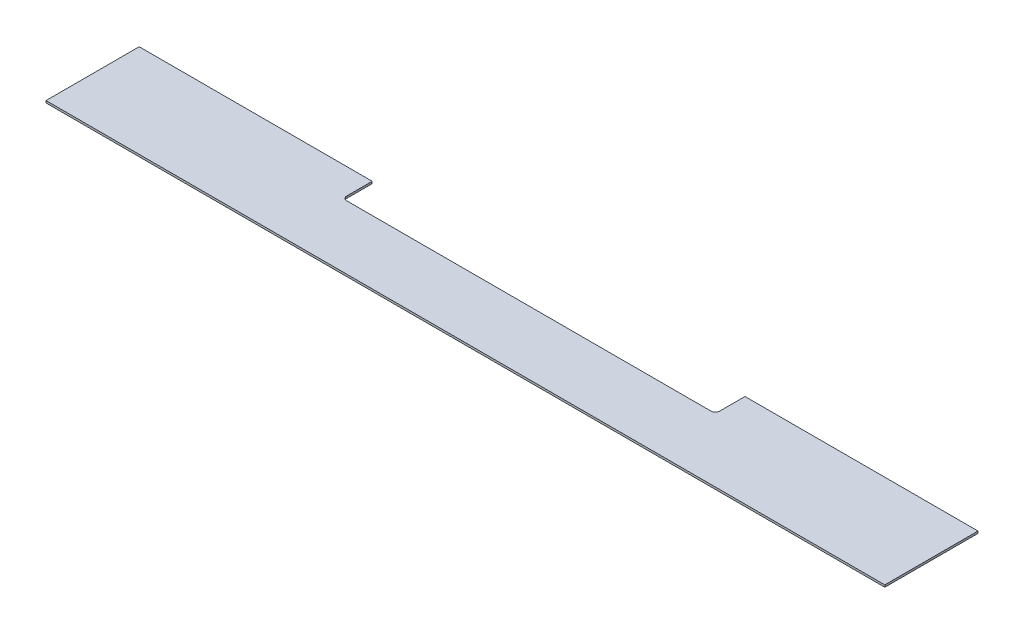
ISO-10303-21;
HEADER;
FILE_DESCRIPTION(('STEP AP214'),'2;1');
FILE_NAME('part.step','',(''),(''),'','','');
FILE_SCHEMA(('AUTOMOTIVE_DESIGN { 1 0 10303 214 1 1 1 1 }'));
ENDSEC;
DATA;
#1=APPLICATION_CONTEXT('core data for automotive mechanical design processes');
#2=APPLICATION_PROTOCOL_DEFINITION('international standard','automotive_design',2000,#1);
#3=PRODUCT_CONTEXT('',#1,'mechanical');
#4=PRODUCT('Part','Part','',(#3));
#5=PRODUCT_RELATED_PRODUCT_CATEGORY('part','',(#4));
#6=PRODUCT_DEFINITION_FORMATION('','',#4);
#7=PRODUCT_DEFINITION_CONTEXT('part definition',#1,'design');
#8=PRODUCT_DEFINITION('design','',#6,#7);
#9=PRODUCT_DEFINITION_SHAPE('','',#8);
#10=(LENGTH_UNIT() NAMED_UNIT(*) SI_UNIT(.MILLI.,.METRE.));
#11=(NAMED_UNIT(*) PLANE_ANGLE_UNIT() SI_UNIT($,.RADIAN.));
#12=(NAMED_UNIT(*) SI_UNIT($,.STERADIAN.) SOLID_ANGLE_UNIT());
#13=UNCERTAINTY_MEASURE_WITH_UNIT(LENGTH_MEASURE(1.E-05),#10,'distance_accuracy_value','');
#14=(GEOMETRIC_REPRESENTATION_CONTEXT(3) GLOBAL_UNCERTAINTY_ASSIGNED_CONTEXT((#13)) GLOBAL_UNIT_ASSIGNED_CONTEXT((#10,
#11,#12)) REPRESENTATION_CONTEXT('',''));
#15=CARTESIAN_POINT('',(0.,0.,0.));
#16=DIRECTION('',(0.,0.,1.));
#17=DIRECTION('',(1.,0.,0.));
#18=AXIS2_PLACEMENT_3D('',#15,#16,#17);
#19=CARTESIAN_POINT('',(0.,3.175,-139.7));
#20=DIRECTION('',(0.,0.,-1.));
#21=DIRECTION('',(-1.,0.,0.));
#22=AXIS2_PLACEMENT_3D('',#19,#20,#21);
#23=PLANE('',#22);
#24=DIRECTION('',(0.,1.,0.));
#25=VECTOR('',#24,1.);
#26=CARTESIAN_POINT('',(349.25,0.,-139.7));
#27=LINE('',#26,#25);
#28=CARTESIAN_POINT('',(349.25,0.,-139.7));
#29=VERTEX_POINT('',#28);
#30=CARTESIAN_POINT('',(349.25,3.175,-139.7));
#31=VERTEX_POINT('',#30);
#32=EDGE_CURVE('E132',#29,#31,#27,.T.);
#33=ORIENTED_EDGE('',*,*,#32,.F.);
#34=DIRECTION('',(1.,0.,0.));
#35=VECTOR('',#34,1.);
#36=CARTESIAN_POINT('',(0.,0.,-139.7));
#37=LINE('',#36,#35);
#38=CARTESIAN_POINT('',(0.,0.,-139.7));
#39=VERTEX_POINT('',#38);
#40=EDGE_CURVE('E138',#39,#29,#37,.T.);
#41=ORIENTED_EDGE('',*,*,#40,.F.);
#42=DIRECTION('',(0.,-1.,0.));
#43=VECTOR('',#42,1.);
#44=CARTESIAN_POINT('',(0.,3.175,-139.7));
#45=LINE('',#44,#43);
#46=CARTESIAN_POINT('',(0.,3.175,-139.7));
#47=VERTEX_POINT('',#46);
#48=EDGE_CURVE('E158',#47,#39,#45,.T.);
#49=ORIENTED_EDGE('',*,*,#48,.F.);
#50=DIRECTION('',(1.,0.,0.));
#51=VECTOR('',#50,1.);
#52=CARTESIAN_POINT('',(0.,3.175,-139.7));
#53=LINE('',#52,#51);
#54=EDGE_CURVE('E298',#47,#31,#53,.T.);
#55=ORIENTED_EDGE('',*,*,#54,.T.);
#56=EDGE_LOOP('',(#33,#41,#49,#55));
#57=FACE_BOUND('',#56,.T.);
#58=ADVANCED_FACE('F35',(#57),#23,.T.);
#59=CARTESIAN_POINT('',(0.,3.175,0.));
#60=DIRECTION('',(-1.,0.,0.));
#61=DIRECTION('',(0.,0.,1.));
#62=AXIS2_PLACEMENT_3D('',#59,#60,#61);
#63=PLANE('',#62);
#64=DIRECTION('',(0.,0.,-1.));
#65=VECTOR('',#64,1.);
#66=CARTESIAN_POINT('',(0.,0.,0.));
#67=LINE('',#66,#65);
#68=CARTESIAN_POINT('',(0.,0.,0.));
#69=VERTEX_POINT('',#68);
#70=EDGE_CURVE('E139',#69,#39,#67,.T.);
#71=ORIENTED_EDGE('',*,*,#70,.F.);
#72=DIRECTION('',(0.,-1.,0.));
#73=VECTOR('',#72,1.);
#74=CARTESIAN_POINT('',(0.,3.175,0.));
#75=LINE('',#74,#73);
#76=CARTESIAN_POINT('',(0.,3.175,0.));
#77=VERTEX_POINT('',#76);
#78=EDGE_CURVE('E151',#77,#69,#75,.T.);
#79=ORIENTED_EDGE('',*,*,#78,.F.);
#80=DIRECTION('',(0.,0.,-1.));
#81=VECTOR('',#80,1.);
#82=CARTESIAN_POINT('',(0.,3.175,0.));
#83=LINE('',#82,#81);
#84=EDGE_CURVE('E150',#77,#47,#83,.T.);
#85=ORIENTED_EDGE('',*,*,#84,.T.);
#86=ORIENTED_EDGE('',*,*,#48,.T.);
#87=EDGE_LOOP('',(#71,#79,#85,#86));
#88=FACE_BOUND('',#87,.T.);
#89=ADVANCED_FACE('F191',(#88),#63,.T.);
#90=CARTESIAN_POINT('',(0.,3.175,0.));
#91=DIRECTION('',(0.,0.,-1.));
#92=DIRECTION('',(-1.,0.,0.));
#93=AXIS2_PLACEMENT_3D('',#90,#91,#92);
#94=PLANE('',#93);
#95=DIRECTION('',(1.,0.,0.));
#96=VECTOR('',#95,1.);
#97=CARTESIAN_POINT('',(0.,0.,0.));
#98=LINE('',#97,#96);
#99=CARTESIAN_POINT('',(1257.3,0.,0.));
#100=VERTEX_POINT('',#99);
#101=EDGE_CURVE('E148',#69,#100,#98,.T.);
#102=ORIENTED_EDGE('',*,*,#101,.T.);
#103=DIRECTION('',(0.,-1.,0.));
#104=VECTOR('',#103,1.);
#105=CARTESIAN_POINT('',(1257.3,3.175,0.));
#106=LINE('',#105,#104);
#107=CARTESIAN_POINT('',(1257.3,3.175,0.));
#108=VERTEX_POINT('',#107);
#109=EDGE_CURVE('E154',#108,#100,#106,.T.);
#110=ORIENTED_EDGE('',*,*,#109,.F.);
#111=DIRECTION('',(1.,0.,0.));
#112=VECTOR('',#111,1.);
#113=CARTESIAN_POINT('',(0.,3.175,0.));
#114=LINE('',#113,#112);
#115=EDGE_CURVE('E160',#77,#108,#114,.T.);
#116=ORIENTED_EDGE('',*,*,#115,.F.);
#117=ORIENTED_EDGE('',*,*,#78,.T.);
#118=EDGE_LOOP('',(#102,#110,#116,#117));
#119=FACE_BOUND('',#118,.T.);
#120=ADVANCED_FACE('F197',(#119),#94,.F.);
#121=CARTESIAN_POINT('',(1257.3,3.175,0.));
#122=DIRECTION('',(-1.,0.,0.));
#123=DIRECTION('',(0.,0.,1.));
#124=AXIS2_PLACEMENT_3D('',#121,#122,#123);
#125=PLANE('',#124);
#126=DIRECTION('',(0.,0.,-1.));
#127=VECTOR('',#126,1.);
#128=CARTESIAN_POINT('',(1257.3,0.,0.));
#129=LINE('',#128,#127);
#130=CARTESIAN_POINT('',(1257.3,0.,-139.7));
#131=VERTEX_POINT('',#130);
#132=EDGE_CURVE('E142',#100,#131,#129,.T.);
#133=ORIENTED_EDGE('',*,*,#132,.T.);
#134=DIRECTION('',(0.,-1.,0.));
#135=VECTOR('',#134,1.);
#136=CARTESIAN_POINT('',(1257.3,3.175,-139.7));
#137=LINE('',#136,#135);
#138=CARTESIAN_POINT('',(1257.3,3.175,-139.7));
#139=VERTEX_POINT('',#138);
#140=EDGE_CURVE('E136',#139,#131,#137,.T.);
#141=ORIENTED_EDGE('',*,*,#140,.F.);
#142=DIRECTION('',(0.,0.,-1.));
#143=VECTOR('',#142,1.);
#144=CARTESIAN_POINT('',(1257.3,3.175,0.));
#145=LINE('',#144,#143);
#146=EDGE_CURVE('E300',#108,#139,#145,.T.);
#147=ORIENTED_EDGE('',*,*,#146,.F.);
#148=ORIENTED_EDGE('',*,*,#109,.T.);
#149=EDGE_LOOP('',(#133,#141,#147,#148));
#150=FACE_BOUND('',#149,.T.);
#151=ADVANCED_FACE('F202',(#150),#125,.F.);
#152=DIRECTION('',(0.,1.,0.));
#153=VECTOR('',#152,1.);
#154=CARTESIAN_POINT('',(908.05,0.,-139.7));
#155=LINE('',#154,#153);
#156=CARTESIAN_POINT('',(908.05,0.,-139.7));
#157=VERTEX_POINT('',#156);
#158=CARTESIAN_POINT('',(908.05,3.175,-139.7));
#159=VERTEX_POINT('',#158);
#160=EDGE_CURVE('E123',#157,#159,#155,.T.);
#161=ORIENTED_EDGE('',*,*,#160,.T.);
#162=EDGE_CURVE('E297',#159,#139,#53,.T.);
#163=ORIENTED_EDGE('',*,*,#162,.T.);
#164=ORIENTED_EDGE('',*,*,#140,.T.);
#165=EDGE_CURVE('E115',#157,#131,#37,.T.);
#166=ORIENTED_EDGE('',*,*,#165,.F.);
#167=EDGE_LOOP('',(#161,#163,#164,#166));
#168=FACE_BOUND('',#167,.T.);
#169=ADVANCED_FACE('F134',(#168),#23,.T.);
#170=CARTESIAN_POINT('',(0.,3.175,0.));
#171=DIRECTION('',(0.,-1.,0.));
#172=DIRECTION('',(0.,0.,-1.));
#173=AXIS2_PLACEMENT_3D('',#170,#171,#172);
#174=PLANE('',#173);
#175=DIRECTION('',(1.,0.,0.));
#176=VECTOR('',#175,1.);
#177=CARTESIAN_POINT('',(349.25,3.175,-95.25));
#178=LINE('',#177,#176);
#179=CARTESIAN_POINT('',(355.6,3.175,-95.25));
#180=VERTEX_POINT('',#179);
#181=CARTESIAN_POINT('',(901.7,3.175,-95.2500000000002));
#182=VERTEX_POINT('',#181);
#183=EDGE_CURVE('E172',#180,#182,#178,.T.);
#184=ORIENTED_EDGE('',*,*,#183,.F.);
#185=CARTESIAN_POINT('',(355.6,3.175,-101.6));
#186=DIRECTION('',(0.,-1.,0.));
#187=DIRECTION('',(0.,0.,-1.));
#188=AXIS2_PLACEMENT_3D('',#185,#186,#187);
#189=CIRCLE('',#188,6.35);
#190=CARTESIAN_POINT('',(349.25,3.175,-101.6));
#191=VERTEX_POINT('',#190);
#192=EDGE_CURVE('E43',#180,#191,#189,.T.);
#193=ORIENTED_EDGE('',*,*,#192,.T.);
#194=DIRECTION('',(0.,0.,1.));
#195=VECTOR('',#194,1.);
#196=CARTESIAN_POINT('',(349.25,3.175,-139.7));
#197=LINE('',#196,#195);
#198=EDGE_CURVE('E179',#31,#191,#197,.T.);
#199=ORIENTED_EDGE('',*,*,#198,.F.);
#200=ORIENTED_EDGE('',*,*,#54,.F.);
#201=ORIENTED_EDGE('',*,*,#84,.F.);
#202=ORIENTED_EDGE('',*,*,#115,.T.);
#203=ORIENTED_EDGE('',*,*,#146,.T.);
#204=ORIENTED_EDGE('',*,*,#162,.F.);
#205=DIRECTION('',(0.,0.,-1.));
#206=VECTOR('',#205,1.);
#207=CARTESIAN_POINT('',(908.05,3.175,-139.7));
#208=LINE('',#207,#206);
#209=CARTESIAN_POINT('',(908.05,3.175,-101.6));
#210=VERTEX_POINT('',#209);
#211=EDGE_CURVE('E129',#210,#159,#208,.T.);
#212=ORIENTED_EDGE('',*,*,#211,.F.);
#213=CARTESIAN_POINT('',(901.7,3.175,-101.6));
#214=DIRECTION('',(0.,-1.,0.));
#215=DIRECTION('',(0.,0.,-1.));
#216=AXIS2_PLACEMENT_3D('',#213,#214,#215);
#217=CIRCLE('',#216,6.35);
#218=EDGE_CURVE('E168',#210,#182,#217,.T.);
#219=ORIENTED_EDGE('',*,*,#218,.T.);
#220=EDGE_LOOP('',(#184,#193,#199,#200,#201,#202,#203,#204,#212,#219));
#221=FACE_BOUND('',#220,.T.);
#222=ADVANCED_FACE('F171',(#221),#174,.F.);
#223=CARTESIAN_POINT('',(0.,0.,0.));
#224=DIRECTION('',(0.,-1.,0.));
#225=DIRECTION('',(0.,0.,-1.));
#226=AXIS2_PLACEMENT_3D('',#223,#224,#225);
#227=PLANE('',#226);
#228=DIRECTION('',(0.,0.,1.));
#229=VECTOR('',#228,1.);
#230=CARTESIAN_POINT('',(349.25,0.,-139.7));
#231=LINE('',#230,#229);
#232=CARTESIAN_POINT('',(349.25,0.,-101.6));
#233=VERTEX_POINT('',#232);
#234=EDGE_CURVE('E289',#29,#233,#231,.T.);
#235=ORIENTED_EDGE('',*,*,#234,.T.);
#236=CARTESIAN_POINT('',(355.6,0.,-101.6));
#237=DIRECTION('',(0.,-1.,0.));
#238=DIRECTION('',(0.,0.,-1.));
#239=AXIS2_PLACEMENT_3D('',#236,#237,#238);
#240=CIRCLE('',#239,6.35);
#241=CARTESIAN_POINT('',(355.6,0.,-95.25));
#242=VERTEX_POINT('',#241);
#243=EDGE_CURVE('E11',#233,#242,#240,.F.);
#244=ORIENTED_EDGE('',*,*,#243,.T.);
#245=DIRECTION('',(1.,0.,0.));
#246=VECTOR('',#245,1.);
#247=CARTESIAN_POINT('',(349.25,0.,-95.25));
#248=LINE('',#247,#246);
#249=CARTESIAN_POINT('',(901.7,0.,-95.2500000000002));
#250=VERTEX_POINT('',#249);
#251=EDGE_CURVE('E124',#242,#250,#248,.T.);
#252=ORIENTED_EDGE('',*,*,#251,.T.);
#253=CARTESIAN_POINT('',(901.7,0.,-101.6));
#254=DIRECTION('',(0.,-1.,0.));
#255=DIRECTION('',(0.,0.,-1.));
#256=AXIS2_PLACEMENT_3D('',#253,#254,#255);
#257=CIRCLE('',#256,6.35);
#258=CARTESIAN_POINT('',(908.05,0.,-101.6));
#259=VERTEX_POINT('',#258);
#260=EDGE_CURVE('E119',#250,#259,#257,.F.);
#261=ORIENTED_EDGE('',*,*,#260,.T.);
#262=DIRECTION('',(0.,0.,-1.));
#263=VECTOR('',#262,1.);
#264=CARTESIAN_POINT('',(908.05,0.,-139.7));
#265=LINE('',#264,#263);
#266=EDGE_CURVE('E110',#259,#157,#265,.T.);
#267=ORIENTED_EDGE('',*,*,#266,.T.);
#268=ORIENTED_EDGE('',*,*,#165,.T.);
#269=ORIENTED_EDGE('',*,*,#132,.F.);
#270=ORIENTED_EDGE('',*,*,#101,.F.);
#271=ORIENTED_EDGE('',*,*,#70,.T.);
#272=ORIENTED_EDGE('',*,*,#40,.T.);
#273=EDGE_LOOP('',(#235,#244,#252,#261,#267,#268,#269,#270,#271,#272));
#274=FACE_BOUND('',#273,.T.);
#275=ADVANCED_FACE('F112',(#274),#227,.T.);
#276=CARTESIAN_POINT('',(349.25,0.,-139.7));
#277=DIRECTION('',(-1.,0.,0.));
#278=DIRECTION('',(0.,0.,1.));
#279=AXIS2_PLACEMENT_3D('',#276,#277,#278);
#280=PLANE('',#279);
#281=ORIENTED_EDGE('',*,*,#198,.T.);
#282=DIRECTION('',(0.,1.,0.));
#283=VECTOR('',#282,1.);
#284=CARTESIAN_POINT('',(349.25,0.,-101.6));
#285=LINE('',#284,#283);
#286=EDGE_CURVE('E50',#191,#233,#285,.F.);
#287=ORIENTED_EDGE('',*,*,#286,.T.);
#288=ORIENTED_EDGE('',*,*,#234,.F.);
#289=ORIENTED_EDGE('',*,*,#32,.T.);
#290=EDGE_LOOP('',(#281,#287,#288,#289));
#291=FACE_BOUND('',#290,.T.);
#292=ADVANCED_FACE('F216',(#291),#280,.F.);
#293=CARTESIAN_POINT('',(908.05,0.,-139.7));
#294=DIRECTION('',(1.,0.,0.));
#295=DIRECTION('',(0.,0.,-1.));
#296=AXIS2_PLACEMENT_3D('',#293,#294,#295);
#297=PLANE('',#296);
#298=ORIENTED_EDGE('',*,*,#266,.F.);
#299=DIRECTION('',(0.,1.,0.));
#300=VECTOR('',#299,1.);
#301=CARTESIAN_POINT('',(908.05,3.175,-101.6));
#302=LINE('',#301,#300);
#303=EDGE_CURVE('E153',#259,#210,#302,.T.);
#304=ORIENTED_EDGE('',*,*,#303,.T.);
#305=ORIENTED_EDGE('',*,*,#211,.T.);
#306=ORIENTED_EDGE('',*,*,#160,.F.);
#307=EDGE_LOOP('',(#298,#304,#305,#306));
#308=FACE_BOUND('',#307,.T.);
#309=ADVANCED_FACE('F127',(#308),#297,.F.);
#310=CARTESIAN_POINT('',(349.25,0.,-95.25));
#311=DIRECTION('',(0.,0.,1.));
#312=DIRECTION('',(1.,0.,0.));
#313=AXIS2_PLACEMENT_3D('',#310,#311,#312);
#314=PLANE('',#313);
#315=ORIENTED_EDGE('',*,*,#183,.T.);
#316=DIRECTION('',(0.,1.,0.));
#317=VECTOR('',#316,1.);
#318=CARTESIAN_POINT('',(901.7,0.,-95.2500000000002));
#319=LINE('',#318,#317);
#320=EDGE_CURVE('E165',#182,#250,#319,.F.);
#321=ORIENTED_EDGE('',*,*,#320,.T.);
#322=ORIENTED_EDGE('',*,*,#251,.F.);
#323=DIRECTION('',(0.,1.,0.));
#324=VECTOR('',#323,1.);
#325=CARTESIAN_POINT('',(355.6,3.175,-95.25));
#326=LINE('',#325,#324);
#327=EDGE_CURVE('E162',#242,#180,#326,.T.);
#328=ORIENTED_EDGE('',*,*,#327,.T.);
#329=EDGE_LOOP('',(#315,#321,#322,#328));
#330=FACE_BOUND('',#329,.T.);
#331=ADVANCED_FACE('F176',(#330),#314,.F.);
#332=CARTESIAN_POINT('',(901.7,0.,-101.6));
#333=DIRECTION('',(0.,-1.,0.));
#334=DIRECTION('',(0.,0.,-1.));
#335=AXIS2_PLACEMENT_3D('',#332,#333,#334);
#336=CYLINDRICAL_SURFACE('',#335,6.35);
#337=ORIENTED_EDGE('',*,*,#260,.F.);
#338=ORIENTED_EDGE('',*,*,#320,.F.);
#339=ORIENTED_EDGE('',*,*,#218,.F.);
#340=ORIENTED_EDGE('',*,*,#303,.F.);
#341=EDGE_LOOP('',(#337,#338,#339,#340));
#342=FACE_BOUND('',#341,.T.);
#343=ADVANCED_FACE('F181',(#342),#336,.F.);
#344=CARTESIAN_POINT('',(355.6,0.,-101.6));
#345=DIRECTION('',(0.,-1.,0.));
#346=DIRECTION('',(0.,0.,-1.));
#347=AXIS2_PLACEMENT_3D('',#344,#345,#346);
#348=CYLINDRICAL_SURFACE('',#347,6.35);
#349=ORIENTED_EDGE('',*,*,#243,.F.);
#350=ORIENTED_EDGE('',*,*,#286,.F.);
#351=ORIENTED_EDGE('',*,*,#192,.F.);
#352=ORIENTED_EDGE('',*,*,#327,.F.);
#353=EDGE_LOOP('',(#349,#350,#351,#352));
#354=FACE_BOUND('',#353,.T.);
#355=ADVANCED_FACE('F37',(#354),#348,.F.);
#356=CLOSED_SHELL('',(#58,#89,#120,#151,#169,#222,#275,#292,#309,#331,#343,#355));
#357=MANIFOLD_SOLID_BREP('B2',#356);
#358=ADVANCED_BREP_SHAPE_REPRESENTATION('',(#18,#357),#14);
#359=SHAPE_DEFINITION_REPRESENTATION(#9,#358);
ENDSEC;
END-ISO-10303-21;
